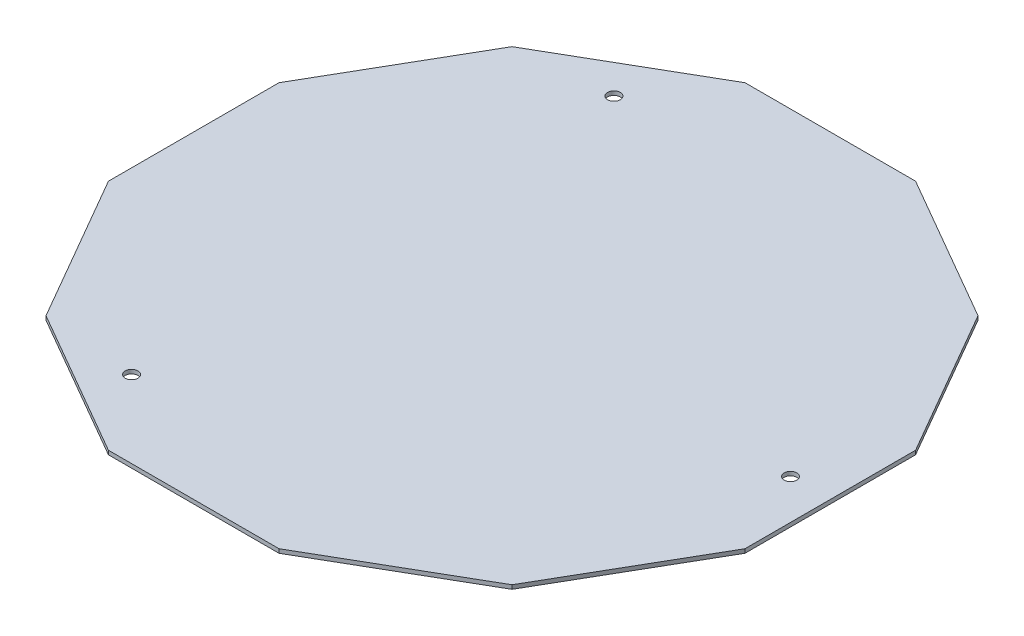
ISO-10303-21;
HEADER;
FILE_DESCRIPTION(('STEP AP214'),'2;1');
FILE_NAME('part.step','',(''),(''),'','','');
FILE_SCHEMA(('AUTOMOTIVE_DESIGN { 1 0 10303 214 1 1 1 1 }'));
ENDSEC;
DATA;
#1=APPLICATION_CONTEXT('core data for automotive mechanical design processes');
#2=APPLICATION_PROTOCOL_DEFINITION('international standard','automotive_design',2000,#1);
#3=PRODUCT_CONTEXT('',#1,'mechanical');
#4=PRODUCT('Part','Part','',(#3));
#5=PRODUCT_RELATED_PRODUCT_CATEGORY('part','',(#4));
#6=PRODUCT_DEFINITION_FORMATION('','',#4);
#7=PRODUCT_DEFINITION_CONTEXT('part definition',#1,'design');
#8=PRODUCT_DEFINITION('design','',#6,#7);
#9=PRODUCT_DEFINITION_SHAPE('','',#8);
#10=(LENGTH_UNIT() NAMED_UNIT(*) SI_UNIT(.MILLI.,.METRE.));
#11=(NAMED_UNIT(*) PLANE_ANGLE_UNIT() SI_UNIT($,.RADIAN.));
#12=(NAMED_UNIT(*) SI_UNIT($,.STERADIAN.) SOLID_ANGLE_UNIT());
#13=UNCERTAINTY_MEASURE_WITH_UNIT(LENGTH_MEASURE(1.E-05),#10,'distance_accuracy_value','');
#14=(GEOMETRIC_REPRESENTATION_CONTEXT(3) GLOBAL_UNCERTAINTY_ASSIGNED_CONTEXT((#13)) GLOBAL_UNIT_ASSIGNED_CONTEXT((#10,
#11,#12)) REPRESENTATION_CONTEXT('',''));
#15=CARTESIAN_POINT('',(0.,0.,0.));
#16=DIRECTION('',(0.,0.,1.));
#17=DIRECTION('',(1.,0.,0.));
#18=AXIS2_PLACEMENT_3D('',#15,#16,#17);
#19=CARTESIAN_POINT('',(80.,1.,21.4359353944898));
#20=DIRECTION('',(-1.,0.,0.));
#21=DIRECTION('',(0.,0.,1.));
#22=AXIS2_PLACEMENT_3D('',#19,#20,#21);
#23=PLANE('',#22);
#24=DIRECTION('',(0.,0.,-1.));
#25=VECTOR('',#24,1.);
#26=CARTESIAN_POINT('',(80.,0.,21.4359353944898));
#27=LINE('',#26,#25);
#28=CARTESIAN_POINT('',(80.,0.,21.4359353944898));
#29=VERTEX_POINT('',#28);
#30=CARTESIAN_POINT('',(79.9999999999999,0.,-21.4359353944899));
#31=VERTEX_POINT('',#30);
#32=EDGE_CURVE('E153',#29,#31,#27,.T.);
#33=ORIENTED_EDGE('',*,*,#32,.T.);
#34=DIRECTION('',(0.,-1.,0.));
#35=VECTOR('',#34,1.);
#36=CARTESIAN_POINT('',(79.9999999999999,1.,-21.4359353944899));
#37=LINE('',#36,#35);
#38=CARTESIAN_POINT('',(79.9999999999999,1.,-21.4359353944899));
#39=VERTEX_POINT('',#38);
#40=EDGE_CURVE('E11',#39,#31,#37,.T.);
#41=ORIENTED_EDGE('',*,*,#40,.F.);
#42=DIRECTION('',(0.,0.,-1.));
#43=VECTOR('',#42,1.);
#44=CARTESIAN_POINT('',(80.,1.,21.4359353944898));
#45=LINE('',#44,#43);
#46=CARTESIAN_POINT('',(80.,1.,21.4359353944898));
#47=VERTEX_POINT('',#46);
#48=EDGE_CURVE('E176',#47,#39,#45,.T.);
#49=ORIENTED_EDGE('',*,*,#48,.F.);
#50=DIRECTION('',(0.,-1.,0.));
#51=VECTOR('',#50,1.);
#52=CARTESIAN_POINT('',(80.,1.,21.4359353944898));
#53=LINE('',#52,#51);
#54=EDGE_CURVE('E149',#47,#29,#53,.T.);
#55=ORIENTED_EDGE('',*,*,#54,.T.);
#56=EDGE_LOOP('',(#33,#41,#49,#55));
#57=FACE_BOUND('',#56,.T.);
#58=ADVANCED_FACE('F33',(#57),#23,.F.);
#59=CARTESIAN_POINT('',(79.9999999999999,1.,-21.4359353944899));
#60=DIRECTION('',(-0.866025403784438,0.,0.500000000000001));
#61=DIRECTION('',(0.500000000000001,0.,0.866025403784438));
#62=AXIS2_PLACEMENT_3D('',#59,#60,#61);
#63=PLANE('',#62);
#64=DIRECTION('',(-0.500000000000001,0.,-0.866025403784438));
#65=VECTOR('',#64,1.);
#66=CARTESIAN_POINT('',(79.9999999999999,0.,-21.4359353944899));
#67=LINE('',#66,#65);
#68=CARTESIAN_POINT('',(58.5640646055101,0.,-58.5640646055102));
#69=VERTEX_POINT('',#68);
#70=EDGE_CURVE('E156',#31,#69,#67,.T.);
#71=ORIENTED_EDGE('',*,*,#70,.T.);
#72=DIRECTION('',(0.,-1.,0.));
#73=VECTOR('',#72,1.);
#74=CARTESIAN_POINT('',(58.5640646055101,1.,-58.5640646055102));
#75=LINE('',#74,#73);
#76=CARTESIAN_POINT('',(58.5640646055101,1.,-58.5640646055102));
#77=VERTEX_POINT('',#76);
#78=EDGE_CURVE('E41',#77,#69,#75,.T.);
#79=ORIENTED_EDGE('',*,*,#78,.F.);
#80=DIRECTION('',(-0.500000000000001,0.,-0.866025403784438));
#81=VECTOR('',#80,1.);
#82=CARTESIAN_POINT('',(79.9999999999999,1.,-21.4359353944899));
#83=LINE('',#82,#81);
#84=EDGE_CURVE('E104',#39,#77,#83,.T.);
#85=ORIENTED_EDGE('',*,*,#84,.F.);
#86=ORIENTED_EDGE('',*,*,#40,.T.);
#87=EDGE_LOOP('',(#71,#79,#85,#86));
#88=FACE_BOUND('',#87,.T.);
#89=ADVANCED_FACE('F256',(#88),#63,.F.);
#90=CARTESIAN_POINT('',(58.5640646055101,1.,-58.5640646055102));
#91=DIRECTION('',(-0.5,0.,0.866025403784439));
#92=DIRECTION('',(0.866025403784439,0.,0.5));
#93=AXIS2_PLACEMENT_3D('',#90,#91,#92);
#94=PLANE('',#93);
#95=DIRECTION('',(-0.866025403784439,0.,-0.5));
#96=VECTOR('',#95,1.);
#97=CARTESIAN_POINT('',(58.5640646055101,0.,-58.5640646055102));
#98=LINE('',#97,#96);
#99=CARTESIAN_POINT('',(21.4359353944898,0.,-80.));
#100=VERTEX_POINT('',#99);
#101=EDGE_CURVE('E159',#69,#100,#98,.T.);
#102=ORIENTED_EDGE('',*,*,#101,.T.);
#103=DIRECTION('',(0.,-1.,0.));
#104=VECTOR('',#103,1.);
#105=CARTESIAN_POINT('',(21.4359353944898,1.,-80.));
#106=LINE('',#105,#104);
#107=CARTESIAN_POINT('',(21.4359353944898,1.,-80.));
#108=VERTEX_POINT('',#107);
#109=EDGE_CURVE('E195',#108,#100,#106,.T.);
#110=ORIENTED_EDGE('',*,*,#109,.F.);
#111=DIRECTION('',(-0.866025403784439,0.,-0.5));
#112=VECTOR('',#111,1.);
#113=CARTESIAN_POINT('',(58.5640646055101,1.,-58.5640646055102));
#114=LINE('',#113,#112);
#115=EDGE_CURVE('E203',#77,#108,#114,.T.);
#116=ORIENTED_EDGE('',*,*,#115,.F.);
#117=ORIENTED_EDGE('',*,*,#78,.T.);
#118=EDGE_LOOP('',(#102,#110,#116,#117));
#119=FACE_BOUND('',#118,.T.);
#120=ADVANCED_FACE('F201',(#119),#94,.F.);
#121=CARTESIAN_POINT('',(21.4359353944898,1.,-80.));
#122=DIRECTION('',(0.,0.,1.));
#123=DIRECTION('',(1.,0.,0.));
#124=AXIS2_PLACEMENT_3D('',#121,#122,#123);
#125=PLANE('',#124);
#126=DIRECTION('',(-1.,0.,0.));
#127=VECTOR('',#126,1.);
#128=CARTESIAN_POINT('',(21.4359353944898,0.,-80.));
#129=LINE('',#128,#127);
#130=CARTESIAN_POINT('',(-21.4359353944899,0.,-79.9999999999999));
#131=VERTEX_POINT('',#130);
#132=EDGE_CURVE('E161',#100,#131,#129,.T.);
#133=ORIENTED_EDGE('',*,*,#132,.T.);
#134=DIRECTION('',(0.,-1.,0.));
#135=VECTOR('',#134,1.);
#136=CARTESIAN_POINT('',(-21.4359353944899,1.,-79.9999999999999));
#137=LINE('',#136,#135);
#138=CARTESIAN_POINT('',(-21.4359353944899,1.,-79.9999999999999));
#139=VERTEX_POINT('',#138);
#140=EDGE_CURVE('E192',#139,#131,#137,.T.);
#141=ORIENTED_EDGE('',*,*,#140,.F.);
#142=DIRECTION('',(-1.,0.,0.));
#143=VECTOR('',#142,1.);
#144=CARTESIAN_POINT('',(21.4359353944898,1.,-80.));
#145=LINE('',#144,#143);
#146=EDGE_CURVE('E221',#108,#139,#145,.T.);
#147=ORIENTED_EDGE('',*,*,#146,.F.);
#148=ORIENTED_EDGE('',*,*,#109,.T.);
#149=EDGE_LOOP('',(#133,#141,#147,#148));
#150=FACE_BOUND('',#149,.T.);
#151=ADVANCED_FACE('F212',(#150),#125,.F.);
#152=CARTESIAN_POINT('',(-21.4359353944899,1.,-79.9999999999999));
#153=DIRECTION('',(0.500000000000001,0.,0.866025403784438));
#154=DIRECTION('',(0.866025403784438,0.,-0.500000000000001));
#155=AXIS2_PLACEMENT_3D('',#152,#153,#154);
#156=PLANE('',#155);
#157=DIRECTION('',(-0.866025403784438,0.,0.500000000000001));
#158=VECTOR('',#157,1.);
#159=CARTESIAN_POINT('',(-21.4359353944899,0.,-79.9999999999999));
#160=LINE('',#159,#158);
#161=CARTESIAN_POINT('',(-58.5640646055102,0.,-58.5640646055102));
#162=VERTEX_POINT('',#161);
#163=EDGE_CURVE('E163',#131,#162,#160,.T.);
#164=ORIENTED_EDGE('',*,*,#163,.T.);
#165=DIRECTION('',(0.,-1.,0.));
#166=VECTOR('',#165,1.);
#167=CARTESIAN_POINT('',(-58.5640646055102,1.,-58.5640646055102));
#168=LINE('',#167,#166);
#169=CARTESIAN_POINT('',(-58.5640646055102,1.,-58.5640646055102));
#170=VERTEX_POINT('',#169);
#171=EDGE_CURVE('E189',#170,#162,#168,.T.);
#172=ORIENTED_EDGE('',*,*,#171,.F.);
#173=DIRECTION('',(-0.866025403784438,0.,0.500000000000001));
#174=VECTOR('',#173,1.);
#175=CARTESIAN_POINT('',(-21.4359353944899,1.,-79.9999999999999));
#176=LINE('',#175,#174);
#177=EDGE_CURVE('E218',#139,#170,#176,.T.);
#178=ORIENTED_EDGE('',*,*,#177,.F.);
#179=ORIENTED_EDGE('',*,*,#140,.T.);
#180=EDGE_LOOP('',(#164,#172,#178,#179));
#181=FACE_BOUND('',#180,.T.);
#182=ADVANCED_FACE('F216',(#181),#156,.F.);
#183=CARTESIAN_POINT('',(-58.5640646055102,1.,-58.5640646055102));
#184=DIRECTION('',(0.866025403784439,0.,0.5));
#185=DIRECTION('',(0.5,0.,-0.866025403784439));
#186=AXIS2_PLACEMENT_3D('',#183,#184,#185);
#187=PLANE('',#186);
#188=DIRECTION('',(-0.5,0.,0.866025403784439));
#189=VECTOR('',#188,1.);
#190=CARTESIAN_POINT('',(-58.5640646055102,0.,-58.5640646055102));
#191=LINE('',#190,#189);
#192=CARTESIAN_POINT('',(-80.,0.,-21.4359353944898));
#193=VERTEX_POINT('',#192);
#194=EDGE_CURVE('E165',#162,#193,#191,.T.);
#195=ORIENTED_EDGE('',*,*,#194,.T.);
#196=DIRECTION('',(0.,-1.,0.));
#197=VECTOR('',#196,1.);
#198=CARTESIAN_POINT('',(-80.,1.,-21.4359353944898));
#199=LINE('',#198,#197);
#200=CARTESIAN_POINT('',(-80.,1.,-21.4359353944898));
#201=VERTEX_POINT('',#200);
#202=EDGE_CURVE('E186',#201,#193,#199,.T.);
#203=ORIENTED_EDGE('',*,*,#202,.F.);
#204=DIRECTION('',(-0.5,0.,0.866025403784439));
#205=VECTOR('',#204,1.);
#206=CARTESIAN_POINT('',(-58.5640646055102,1.,-58.5640646055102));
#207=LINE('',#206,#205);
#208=EDGE_CURVE('E220',#170,#201,#207,.T.);
#209=ORIENTED_EDGE('',*,*,#208,.F.);
#210=ORIENTED_EDGE('',*,*,#171,.T.);
#211=EDGE_LOOP('',(#195,#203,#209,#210));
#212=FACE_BOUND('',#211,.T.);
#213=ADVANCED_FACE('F269',(#212),#187,.F.);
#214=CARTESIAN_POINT('',(-80.,1.,-21.4359353944898));
#215=DIRECTION('',(1.,0.,0.));
#216=DIRECTION('',(0.,0.,-1.));
#217=AXIS2_PLACEMENT_3D('',#214,#215,#216);
#218=PLANE('',#217);
#219=DIRECTION('',(0.,0.,1.));
#220=VECTOR('',#219,1.);
#221=CARTESIAN_POINT('',(-80.,0.,-21.4359353944898));
#222=LINE('',#221,#220);
#223=CARTESIAN_POINT('',(-79.9999999999999,0.,21.4359353944899));
#224=VERTEX_POINT('',#223);
#225=EDGE_CURVE('E167',#193,#224,#222,.T.);
#226=ORIENTED_EDGE('',*,*,#225,.T.);
#227=DIRECTION('',(0.,-1.,0.));
#228=VECTOR('',#227,1.);
#229=CARTESIAN_POINT('',(-79.9999999999999,1.,21.4359353944899));
#230=LINE('',#229,#228);
#231=CARTESIAN_POINT('',(-79.9999999999999,1.,21.4359353944899));
#232=VERTEX_POINT('',#231);
#233=EDGE_CURVE('E183',#232,#224,#230,.T.);
#234=ORIENTED_EDGE('',*,*,#233,.F.);
#235=DIRECTION('',(0.,0.,1.));
#236=VECTOR('',#235,1.);
#237=CARTESIAN_POINT('',(-80.,1.,-21.4359353944898));
#238=LINE('',#237,#236);
#239=EDGE_CURVE('E223',#201,#232,#238,.T.);
#240=ORIENTED_EDGE('',*,*,#239,.F.);
#241=ORIENTED_EDGE('',*,*,#202,.T.);
#242=EDGE_LOOP('',(#226,#234,#240,#241));
#243=FACE_BOUND('',#242,.T.);
#244=ADVANCED_FACE('F272',(#243),#218,.F.);
#245=CARTESIAN_POINT('',(-79.9999999999999,1.,21.4359353944899));
#246=DIRECTION('',(0.866025403784438,0.,-0.5));
#247=DIRECTION('',(-0.5,0.,-0.866025403784438));
#248=AXIS2_PLACEMENT_3D('',#245,#246,#247);
#249=PLANE('',#248);
#250=DIRECTION('',(0.5,0.,0.866025403784438));
#251=VECTOR('',#250,1.);
#252=CARTESIAN_POINT('',(-79.9999999999999,0.,21.4359353944899));
#253=LINE('',#252,#251);
#254=CARTESIAN_POINT('',(-58.5640646055101,0.,58.5640646055102));
#255=VERTEX_POINT('',#254);
#256=EDGE_CURVE('E169',#224,#255,#253,.T.);
#257=ORIENTED_EDGE('',*,*,#256,.T.);
#258=DIRECTION('',(0.,-1.,0.));
#259=VECTOR('',#258,1.);
#260=CARTESIAN_POINT('',(-58.5640646055101,1.,58.5640646055102));
#261=LINE('',#260,#259);
#262=CARTESIAN_POINT('',(-58.5640646055101,1.,58.5640646055102));
#263=VERTEX_POINT('',#262);
#264=EDGE_CURVE('E180',#263,#255,#261,.T.);
#265=ORIENTED_EDGE('',*,*,#264,.F.);
#266=DIRECTION('',(0.5,0.,0.866025403784438));
#267=VECTOR('',#266,1.);
#268=CARTESIAN_POINT('',(-79.9999999999999,1.,21.4359353944899));
#269=LINE('',#268,#267);
#270=EDGE_CURVE('E229',#232,#263,#269,.T.);
#271=ORIENTED_EDGE('',*,*,#270,.F.);
#272=ORIENTED_EDGE('',*,*,#233,.T.);
#273=EDGE_LOOP('',(#257,#265,#271,#272));
#274=FACE_BOUND('',#273,.T.);
#275=ADVANCED_FACE('F235',(#274),#249,.F.);
#276=CARTESIAN_POINT('',(-58.5640646055101,1.,58.5640646055102));
#277=DIRECTION('',(0.5,0.,-0.866025403784439));
#278=DIRECTION('',(-0.866025403784439,0.,-0.5));
#279=AXIS2_PLACEMENT_3D('',#276,#277,#278);
#280=PLANE('',#279);
#281=DIRECTION('',(0.866025403784439,0.,0.5));
#282=VECTOR('',#281,1.);
#283=CARTESIAN_POINT('',(-58.5640646055101,0.,58.5640646055102));
#284=LINE('',#283,#282);
#285=CARTESIAN_POINT('',(-21.4359353944897,0.,80.));
#286=VERTEX_POINT('',#285);
#287=EDGE_CURVE('E171',#255,#286,#284,.T.);
#288=ORIENTED_EDGE('',*,*,#287,.T.);
#289=DIRECTION('',(0.,-1.,0.));
#290=VECTOR('',#289,1.);
#291=CARTESIAN_POINT('',(-21.4359353944897,1.,80.));
#292=LINE('',#291,#290);
#293=CARTESIAN_POINT('',(-21.4359353944897,1.,80.));
#294=VERTEX_POINT('',#293);
#295=EDGE_CURVE('E144',#294,#286,#292,.T.);
#296=ORIENTED_EDGE('',*,*,#295,.F.);
#297=DIRECTION('',(0.866025403784439,0.,0.5));
#298=VECTOR('',#297,1.);
#299=CARTESIAN_POINT('',(-58.5640646055101,1.,58.5640646055102));
#300=LINE('',#299,#298);
#301=EDGE_CURVE('E135',#263,#294,#300,.T.);
#302=ORIENTED_EDGE('',*,*,#301,.F.);
#303=ORIENTED_EDGE('',*,*,#264,.T.);
#304=EDGE_LOOP('',(#288,#296,#302,#303));
#305=FACE_BOUND('',#304,.T.);
#306=ADVANCED_FACE('F239',(#305),#280,.F.);
#307=CARTESIAN_POINT('',(-21.4359353944897,1.,80.));
#308=DIRECTION('',(0.,0.,-1.));
#309=DIRECTION('',(-1.,0.,0.));
#310=AXIS2_PLACEMENT_3D('',#307,#308,#309);
#311=PLANE('',#310);
#312=DIRECTION('',(1.,0.,0.));
#313=VECTOR('',#312,1.);
#314=CARTESIAN_POINT('',(-21.4359353944897,0.,80.));
#315=LINE('',#314,#313);
#316=CARTESIAN_POINT('',(21.4359353944899,0.,79.9999999999999));
#317=VERTEX_POINT('',#316);
#318=EDGE_CURVE('E143',#286,#317,#315,.T.);
#319=ORIENTED_EDGE('',*,*,#318,.T.);
#320=DIRECTION('',(0.,-1.,0.));
#321=VECTOR('',#320,1.);
#322=CARTESIAN_POINT('',(21.4359353944899,1.,79.9999999999999));
#323=LINE('',#322,#321);
#324=CARTESIAN_POINT('',(21.4359353944899,1.,79.9999999999999));
#325=VERTEX_POINT('',#324);
#326=EDGE_CURVE('E140',#325,#317,#323,.T.);
#327=ORIENTED_EDGE('',*,*,#326,.F.);
#328=DIRECTION('',(1.,0.,0.));
#329=VECTOR('',#328,1.);
#330=CARTESIAN_POINT('',(-21.4359353944897,1.,80.));
#331=LINE('',#330,#329);
#332=EDGE_CURVE('E129',#294,#325,#331,.T.);
#333=ORIENTED_EDGE('',*,*,#332,.F.);
#334=ORIENTED_EDGE('',*,*,#295,.T.);
#335=EDGE_LOOP('',(#319,#327,#333,#334));
#336=FACE_BOUND('',#335,.T.);
#337=ADVANCED_FACE('F141',(#336),#311,.F.);
#338=CARTESIAN_POINT('',(21.4359353944899,1.,79.9999999999999));
#339=DIRECTION('',(-0.5,0.,-0.866025403784439));
#340=DIRECTION('',(-0.866025403784438,0.,0.5));
#341=AXIS2_PLACEMENT_3D('',#338,#339,#340);
#342=PLANE('',#341);
#343=DIRECTION('',(0.866025403784438,0.,-0.5));
#344=VECTOR('',#343,1.);
#345=CARTESIAN_POINT('',(21.4359353944899,0.,79.9999999999999));
#346=LINE('',#345,#344);
#347=CARTESIAN_POINT('',(58.5640646055102,0.,58.5640646055101));
#348=VERTEX_POINT('',#347);
#349=EDGE_CURVE('E90',#317,#348,#346,.T.);
#350=ORIENTED_EDGE('',*,*,#349,.T.);
#351=DIRECTION('',(0.,-1.,0.));
#352=VECTOR('',#351,1.);
#353=CARTESIAN_POINT('',(58.5640646055102,1.,58.5640646055101));
#354=LINE('',#353,#352);
#355=CARTESIAN_POINT('',(58.5640646055102,1.,58.5640646055101));
#356=VERTEX_POINT('',#355);
#357=EDGE_CURVE('E145',#356,#348,#354,.T.);
#358=ORIENTED_EDGE('',*,*,#357,.F.);
#359=DIRECTION('',(0.866025403784438,0.,-0.5));
#360=VECTOR('',#359,1.);
#361=CARTESIAN_POINT('',(21.4359353944899,1.,79.9999999999999));
#362=LINE('',#361,#360);
#363=EDGE_CURVE('E133',#325,#356,#362,.T.);
#364=ORIENTED_EDGE('',*,*,#363,.F.);
#365=ORIENTED_EDGE('',*,*,#326,.T.);
#366=EDGE_LOOP('',(#350,#358,#364,#365));
#367=FACE_BOUND('',#366,.T.);
#368=ADVANCED_FACE('F147',(#367),#342,.F.);
#369=CARTESIAN_POINT('',(58.5640646055102,1.,58.5640646055101));
#370=DIRECTION('',(-0.866025403784439,0.,-0.5));
#371=DIRECTION('',(-0.5,0.,0.866025403784439));
#372=AXIS2_PLACEMENT_3D('',#369,#370,#371);
#373=PLANE('',#372);
#374=DIRECTION('',(0.5,0.,-0.866025403784439));
#375=VECTOR('',#374,1.);
#376=CARTESIAN_POINT('',(58.5640646055102,0.,58.5640646055101));
#377=LINE('',#376,#375);
#378=EDGE_CURVE('E96',#348,#29,#377,.T.);
#379=ORIENTED_EDGE('',*,*,#378,.T.);
#380=ORIENTED_EDGE('',*,*,#54,.F.);
#381=DIRECTION('',(0.5,0.,-0.866025403784439));
#382=VECTOR('',#381,1.);
#383=CARTESIAN_POINT('',(58.5640646055102,1.,58.5640646055101));
#384=LINE('',#383,#382);
#385=EDGE_CURVE('E49',#356,#47,#384,.T.);
#386=ORIENTED_EDGE('',*,*,#385,.F.);
#387=ORIENTED_EDGE('',*,*,#357,.T.);
#388=EDGE_LOOP('',(#379,#380,#386,#387));
#389=FACE_BOUND('',#388,.T.);
#390=ADVANCED_FACE('F243',(#389),#373,.F.);
#391=CARTESIAN_POINT('',(0.,1.,0.));
#392=DIRECTION('',(0.,1.,0.));
#393=DIRECTION('',(0.,0.,1.));
#394=AXIS2_PLACEMENT_3D('',#391,#392,#393);
#395=PLANE('',#394);
#396=CARTESIAN_POINT('',(70.,1.,2.44403693719019E-13));
#397=DIRECTION('',(0.,1.,0.));
#398=DIRECTION('',(0.,0.,1.));
#399=AXIS2_PLACEMENT_3D('',#396,#397,#398);
#400=CIRCLE('',#399,1.6);
#401=CARTESIAN_POINT('',(70.,1.,1.60000000000024));
#402=VERTEX_POINT('',#401);
#403=EDGE_CURVE('E340',#402,#402,#400,.T.);
#404=ORIENTED_EDGE('',*,*,#403,.F.);
#405=EDGE_LOOP('',(#404));
#406=FACE_BOUND('',#405,.T.);
#407=CARTESIAN_POINT('',(-34.9999999999997,1.,60.6217782649109));
#408=DIRECTION('',(0.,1.,0.));
#409=DIRECTION('',(0.,0.,1.));
#410=AXIS2_PLACEMENT_3D('',#407,#408,#409);
#411=CIRCLE('',#410,1.6);
#412=CARTESIAN_POINT('',(-34.9999999999997,1.,62.2217782649109));
#413=VERTEX_POINT('',#412);
#414=EDGE_CURVE('E344',#413,#413,#411,.T.);
#415=ORIENTED_EDGE('',*,*,#414,.F.);
#416=EDGE_LOOP('',(#415));
#417=FACE_BOUND('',#416,.T.);
#418=CARTESIAN_POINT('',(-35.0000000000001,1.,-60.6217782649107));
#419=DIRECTION('',(0.,1.,0.));
#420=DIRECTION('',(0.,0.,1.));
#421=AXIS2_PLACEMENT_3D('',#418,#419,#420);
#422=CIRCLE('',#421,1.6);
#423=CARTESIAN_POINT('',(-35.0000000000001,1.,-59.0217782649107));
#424=VERTEX_POINT('',#423);
#425=EDGE_CURVE('E353',#424,#424,#422,.T.);
#426=ORIENTED_EDGE('',*,*,#425,.F.);
#427=EDGE_LOOP('',(#426));
#428=FACE_BOUND('',#427,.T.);
#429=ORIENTED_EDGE('',*,*,#48,.T.);
#430=ORIENTED_EDGE('',*,*,#84,.T.);
#431=ORIENTED_EDGE('',*,*,#115,.T.);
#432=ORIENTED_EDGE('',*,*,#146,.T.);
#433=ORIENTED_EDGE('',*,*,#177,.T.);
#434=ORIENTED_EDGE('',*,*,#208,.T.);
#435=ORIENTED_EDGE('',*,*,#239,.T.);
#436=ORIENTED_EDGE('',*,*,#270,.T.);
#437=ORIENTED_EDGE('',*,*,#301,.T.);
#438=ORIENTED_EDGE('',*,*,#332,.T.);
#439=ORIENTED_EDGE('',*,*,#363,.T.);
#440=ORIENTED_EDGE('',*,*,#385,.T.);
#441=EDGE_LOOP('',(#429,#430,#431,#432,#433,#434,#435,#436,#437,#438,#439,#440));
#442=FACE_BOUND('',#441,.T.);
#443=ADVANCED_FACE('F131',(#406,#417,#428,#442),#395,.T.);
#444=CARTESIAN_POINT('',(0.,0.,0.));
#445=DIRECTION('',(0.,1.,0.));
#446=DIRECTION('',(0.,0.,1.));
#447=AXIS2_PLACEMENT_3D('',#444,#445,#446);
#448=PLANE('',#447);
#449=CARTESIAN_POINT('',(70.,0.,2.44403693719019E-13));
#450=DIRECTION('',(0.,1.,0.));
#451=DIRECTION('',(0.,0.,1.));
#452=AXIS2_PLACEMENT_3D('',#449,#450,#451);
#453=CIRCLE('',#452,1.6);
#454=CARTESIAN_POINT('',(70.,0.,1.60000000000024));
#455=VERTEX_POINT('',#454);
#456=EDGE_CURVE('E343',#455,#455,#453,.F.);
#457=ORIENTED_EDGE('',*,*,#456,.F.);
#458=EDGE_LOOP('',(#457));
#459=FACE_BOUND('',#458,.T.);
#460=CARTESIAN_POINT('',(-34.9999999999997,0.,60.6217782649109));
#461=DIRECTION('',(0.,1.,0.));
#462=DIRECTION('',(0.,0.,1.));
#463=AXIS2_PLACEMENT_3D('',#460,#461,#462);
#464=CIRCLE('',#463,1.6);
#465=CARTESIAN_POINT('',(-34.9999999999997,0.,62.2217782649109));
#466=VERTEX_POINT('',#465);
#467=EDGE_CURVE('E347',#466,#466,#464,.F.);
#468=ORIENTED_EDGE('',*,*,#467,.F.);
#469=EDGE_LOOP('',(#468));
#470=FACE_BOUND('',#469,.T.);
#471=CARTESIAN_POINT('',(-35.0000000000001,0.,-60.6217782649107));
#472=DIRECTION('',(0.,1.,0.));
#473=DIRECTION('',(0.,0.,1.));
#474=AXIS2_PLACEMENT_3D('',#471,#472,#473);
#475=CIRCLE('',#474,1.6);
#476=CARTESIAN_POINT('',(-35.0000000000001,0.,-59.0217782649107));
#477=VERTEX_POINT('',#476);
#478=EDGE_CURVE('E157',#477,#477,#475,.F.);
#479=ORIENTED_EDGE('',*,*,#478,.F.);
#480=EDGE_LOOP('',(#479));
#481=FACE_BOUND('',#480,.T.);
#482=ORIENTED_EDGE('',*,*,#32,.F.);
#483=ORIENTED_EDGE('',*,*,#378,.F.);
#484=ORIENTED_EDGE('',*,*,#349,.F.);
#485=ORIENTED_EDGE('',*,*,#318,.F.);
#486=ORIENTED_EDGE('',*,*,#287,.F.);
#487=ORIENTED_EDGE('',*,*,#256,.F.);
#488=ORIENTED_EDGE('',*,*,#225,.F.);
#489=ORIENTED_EDGE('',*,*,#194,.F.);
#490=ORIENTED_EDGE('',*,*,#163,.F.);
#491=ORIENTED_EDGE('',*,*,#132,.F.);
#492=ORIENTED_EDGE('',*,*,#101,.F.);
#493=ORIENTED_EDGE('',*,*,#70,.F.);
#494=EDGE_LOOP('',(#482,#483,#484,#485,#486,#487,#488,#489,#490,#491,#492,#493));
#495=FACE_BOUND('',#494,.T.);
#496=ADVANCED_FACE('F207',(#459,#470,#481,#495),#448,.F.);
#497=CARTESIAN_POINT('',(-35.0000000000001,-0.000999999999999916,-60.6217782649107));
#498=DIRECTION('',(0.,1.,0.));
#499=DIRECTION('',(0.,0.,1.));
#500=AXIS2_PLACEMENT_3D('',#497,#498,#499);
#501=CYLINDRICAL_SURFACE('',#500,1.6);
#502=ORIENTED_EDGE('',*,*,#425,.T.);
#503=EDGE_LOOP('',(#502));
#504=FACE_BOUND('',#503,.T.);
#505=ORIENTED_EDGE('',*,*,#478,.T.);
#506=EDGE_LOOP('',(#505));
#507=FACE_BOUND('',#506,.T.);
#508=ADVANCED_FACE('F300',(#504,#507),#501,.F.);
#509=CARTESIAN_POINT('',(-34.9999999999997,-0.000999999999999916,60.6217782649109));
#510=DIRECTION('',(0.,1.,0.));
#511=DIRECTION('',(0.,0.,1.));
#512=AXIS2_PLACEMENT_3D('',#509,#510,#511);
#513=CYLINDRICAL_SURFACE('',#512,1.6);
#514=ORIENTED_EDGE('',*,*,#414,.T.);
#515=EDGE_LOOP('',(#514));
#516=FACE_BOUND('',#515,.T.);
#517=ORIENTED_EDGE('',*,*,#467,.T.);
#518=EDGE_LOOP('',(#517));
#519=FACE_BOUND('',#518,.T.);
#520=ADVANCED_FACE('F305',(#516,#519),#513,.F.);
#521=CARTESIAN_POINT('',(70.,-0.000999999999999916,2.44403693719019E-13));
#522=DIRECTION('',(0.,1.,0.));
#523=DIRECTION('',(0.,0.,1.));
#524=AXIS2_PLACEMENT_3D('',#521,#522,#523);
#525=CYLINDRICAL_SURFACE('',#524,1.6);
#526=ORIENTED_EDGE('',*,*,#403,.T.);
#527=EDGE_LOOP('',(#526));
#528=FACE_BOUND('',#527,.T.);
#529=ORIENTED_EDGE('',*,*,#456,.T.);
#530=EDGE_LOOP('',(#529));
#531=FACE_BOUND('',#530,.T.);
#532=ADVANCED_FACE('F316',(#528,#531),#525,.F.);
#533=CLOSED_SHELL('',(#58,#89,#120,#151,#182,#213,#244,#275,#306,#337,#368,#390,#443,#496,#508,
#520,#532));
#534=MANIFOLD_SOLID_BREP('B2',#533);
#535=ADVANCED_BREP_SHAPE_REPRESENTATION('',(#18,#534),#14);
#536=SHAPE_DEFINITION_REPRESENTATION(#9,#535);
ENDSEC;
END-ISO-10303-21;
